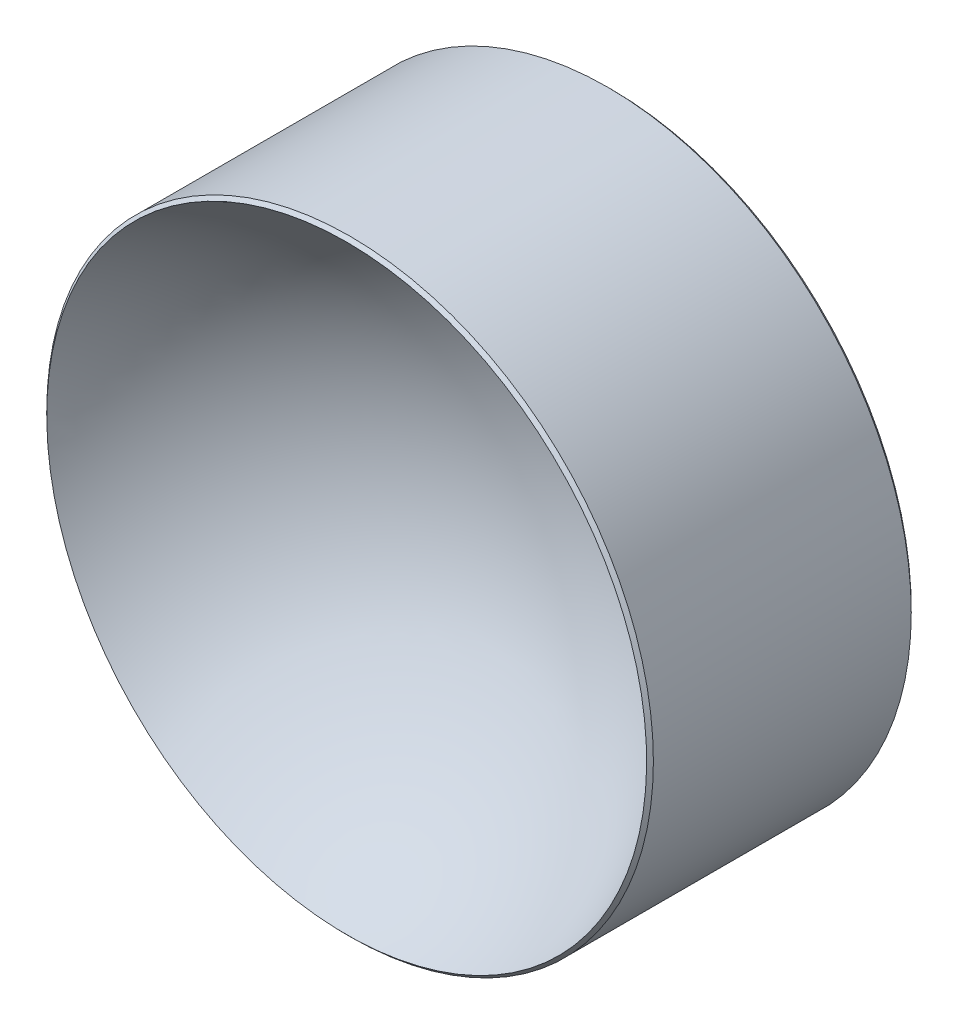
ISO-10303-21;
HEADER;
FILE_DESCRIPTION(('STEP AP214'),'2;1');
FILE_NAME('part.step','',(''),(''),'','','');
FILE_SCHEMA(('AUTOMOTIVE_DESIGN { 1 0 10303 214 1 1 1 1 }'));
ENDSEC;
DATA;
#1=APPLICATION_CONTEXT('core data for automotive mechanical design processes');
#2=APPLICATION_PROTOCOL_DEFINITION('international standard','automotive_design',2000,#1);
#3=PRODUCT_CONTEXT('',#1,'mechanical');
#4=PRODUCT('Part','Part','',(#3));
#5=PRODUCT_RELATED_PRODUCT_CATEGORY('part','',(#4));
#6=PRODUCT_DEFINITION_FORMATION('','',#4);
#7=PRODUCT_DEFINITION_CONTEXT('part definition',#1,'design');
#8=PRODUCT_DEFINITION('design','',#6,#7);
#9=PRODUCT_DEFINITION_SHAPE('','',#8);
#10=(LENGTH_UNIT() NAMED_UNIT(*) SI_UNIT(.MILLI.,.METRE.));
#11=(NAMED_UNIT(*) PLANE_ANGLE_UNIT() SI_UNIT($,.RADIAN.));
#12=(NAMED_UNIT(*) SI_UNIT($,.STERADIAN.) SOLID_ANGLE_UNIT());
#13=UNCERTAINTY_MEASURE_WITH_UNIT(LENGTH_MEASURE(1.E-05),#10,'distance_accuracy_value','');
#14=(GEOMETRIC_REPRESENTATION_CONTEXT(3) GLOBAL_UNCERTAINTY_ASSIGNED_CONTEXT((#13)) GLOBAL_UNIT_ASSIGNED_CONTEXT((#10,
#11,#12)) REPRESENTATION_CONTEXT('',''));
#15=CARTESIAN_POINT('',(0.,0.,0.));
#16=DIRECTION('',(0.,0.,1.));
#17=DIRECTION('',(1.,0.,0.));
#18=AXIS2_PLACEMENT_3D('',#15,#16,#17);
#19=CARTESIAN_POINT('',(0.,0.,15.3));
#20=DIRECTION('',(0.,0.,-1.));
#21=DIRECTION('',(0.,1.,0.));
#22=AXIS2_PLACEMENT_3D('',#19,#20,#21);
#23=SPHERICAL_SURFACE('',#22,13.8);
#24=CARTESIAN_POINT('',(0.,0.,9.5796763685585));
#25=DIRECTION('',(0.,0.,-1.));
#26=DIRECTION('',(0.,1.,0.));
#27=AXIS2_PLACEMENT_3D('',#24,#25,#26);
#28=CIRCLE('',#27,12.5585786437627);
#29=CARTESIAN_POINT('',(0.,12.5585786437627,9.5796763685585));
#30=VERTEX_POINT('',#29);
#31=EDGE_CURVE('E9',#30,#30,#28,.T.);
#32=ORIENTED_EDGE('',*,*,#31,.F.);
#33=EDGE_LOOP('',(#32));
#34=FACE_BOUND('',#33,.T.);
#35=ADVANCED_FACE('F14',(#34),#23,.F.);
#36=CARTESIAN_POINT('',(0.,0.,9.43825501232122));
#37=DIRECTION('',(0.,0.,-1.));
#38=DIRECTION('',(0.,1.,0.));
#39=AXIS2_PLACEMENT_3D('',#36,#37,#38);
#40=CONICAL_SURFACE('',#39,12.7,0.785398163397559);
#41=ORIENTED_EDGE('',*,*,#31,.T.);
#42=EDGE_LOOP('',(#41));
#43=FACE_BOUND('',#42,.T.);
#44=CARTESIAN_POINT('',(0.,0.,9.43825501232122));
#45=DIRECTION('',(0.,0.,-1.));
#46=DIRECTION('',(0.,1.,0.));
#47=AXIS2_PLACEMENT_3D('',#44,#45,#46);
#48=CIRCLE('',#47,12.7);
#49=CARTESIAN_POINT('',(0.,12.7,9.43825501232122));
#50=VERTEX_POINT('',#49);
#51=EDGE_CURVE('E20',#50,#50,#48,.T.);
#52=ORIENTED_EDGE('',*,*,#51,.F.);
#53=EDGE_LOOP('',(#52));
#54=FACE_BOUND('',#53,.T.);
#55=ADVANCED_FACE('F48',(#43,#54),#40,.T.);
#56=CARTESIAN_POINT('',(0.,0.,-1.5));
#57=DIRECTION('',(0.,0.,-1.));
#58=DIRECTION('',(0.,1.,0.));
#59=AXIS2_PLACEMENT_3D('',#56,#57,#58);
#60=CYLINDRICAL_SURFACE('',#59,12.7);
#61=ORIENTED_EDGE('',*,*,#51,.T.);
#62=EDGE_LOOP('',(#61));
#63=FACE_BOUND('',#62,.T.);
#64=CARTESIAN_POINT('',(0.,0.,-1.35857864376269));
#65=DIRECTION('',(0.,0.,-1.));
#66=DIRECTION('',(0.,1.,0.));
#67=AXIS2_PLACEMENT_3D('',#64,#65,#66);
#68=CIRCLE('',#67,12.7);
#69=CARTESIAN_POINT('',(0.,12.7,-1.35857864376269));
#70=VERTEX_POINT('',#69);
#71=EDGE_CURVE('E24',#70,#70,#68,.T.);
#72=ORIENTED_EDGE('',*,*,#71,.F.);
#73=EDGE_LOOP('',(#72));
#74=FACE_BOUND('',#73,.T.);
#75=ADVANCED_FACE('F38',(#63,#74),#60,.T.);
#76=CARTESIAN_POINT('',(0.,0.,-1.5));
#77=DIRECTION('',(0.,0.,1.));
#78=DIRECTION('',(0.,-1.,0.));
#79=AXIS2_PLACEMENT_3D('',#76,#77,#78);
#80=CONICAL_SURFACE('',#79,12.5585786437627,0.785398163397449);
#81=ORIENTED_EDGE('',*,*,#71,.T.);
#82=EDGE_LOOP('',(#81));
#83=FACE_BOUND('',#82,.T.);
#84=CARTESIAN_POINT('',(0.,0.,-1.5));
#85=DIRECTION('',(0.,0.,-1.));
#86=DIRECTION('',(0.,1.,0.));
#87=AXIS2_PLACEMENT_3D('',#84,#85,#86);
#88=CIRCLE('',#87,12.5585786437627);
#89=CARTESIAN_POINT('',(0.,12.5585786437627,-1.5));
#90=VERTEX_POINT('',#89);
#91=EDGE_CURVE('E28',#90,#90,#88,.T.);
#92=ORIENTED_EDGE('',*,*,#91,.F.);
#93=EDGE_LOOP('',(#92));
#94=FACE_BOUND('',#93,.T.);
#95=ADVANCED_FACE('F36',(#83,#94),#80,.T.);
#96=CARTESIAN_POINT('',(0.,0.,-1.5));
#97=DIRECTION('',(0.,0.,-1.));
#98=DIRECTION('',(0.,1.,0.));
#99=AXIS2_PLACEMENT_3D('',#96,#97,#98);
#100=PLANE('',#99);
#101=ORIENTED_EDGE('',*,*,#91,.T.);
#102=EDGE_LOOP('',(#101));
#103=FACE_BOUND('',#102,.T.);
#104=ADVANCED_FACE('F34',(#103),#100,.T.);
#105=CLOSED_SHELL('',(#35,#55,#75,#95,#104));
#106=MANIFOLD_SOLID_BREP('B1',#105);
#107=ADVANCED_BREP_SHAPE_REPRESENTATION('',(#18,#106),#14);
#108=SHAPE_DEFINITION_REPRESENTATION(#9,#107);
ENDSEC;
END-ISO-10303-21;
